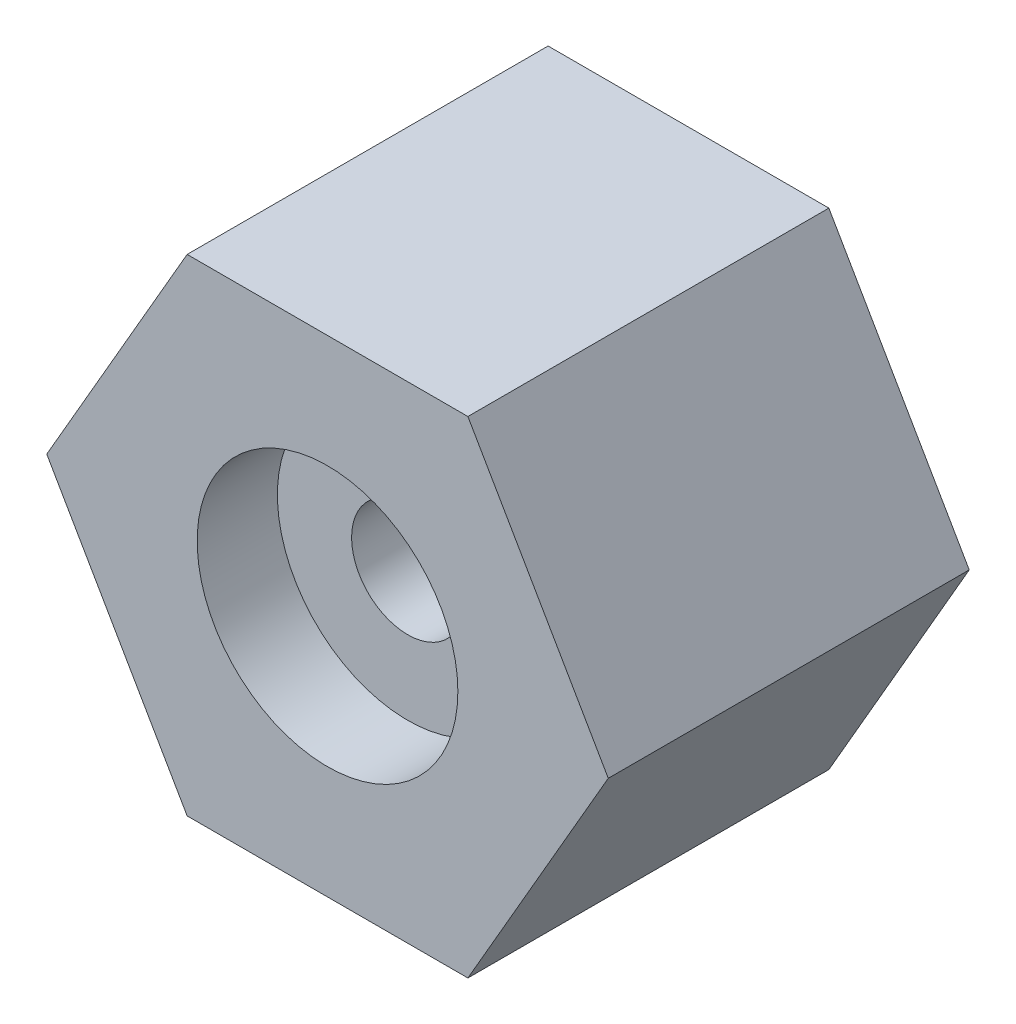
ISO-10303-21;
HEADER;
FILE_DESCRIPTION(('STEP AP214'),'2;1');
FILE_NAME('part.step','',(''),(''),'','','');
FILE_SCHEMA(('AUTOMOTIVE_DESIGN { 1 0 10303 214 1 1 1 1 }'));
ENDSEC;
DATA;
#1=APPLICATION_CONTEXT('core data for automotive mechanical design processes');
#2=APPLICATION_PROTOCOL_DEFINITION('international standard','automotive_design',2000,#1);
#3=PRODUCT_CONTEXT('',#1,'mechanical');
#4=PRODUCT('Part','Part','',(#3));
#5=PRODUCT_RELATED_PRODUCT_CATEGORY('part','',(#4));
#6=PRODUCT_DEFINITION_FORMATION('','',#4);
#7=PRODUCT_DEFINITION_CONTEXT('part definition',#1,'design');
#8=PRODUCT_DEFINITION('design','',#6,#7);
#9=PRODUCT_DEFINITION_SHAPE('','',#8);
#10=(LENGTH_UNIT() NAMED_UNIT(*) SI_UNIT(.MILLI.,.METRE.));
#11=(NAMED_UNIT(*) PLANE_ANGLE_UNIT() SI_UNIT($,.RADIAN.));
#12=(NAMED_UNIT(*) SI_UNIT($,.STERADIAN.) SOLID_ANGLE_UNIT());
#13=UNCERTAINTY_MEASURE_WITH_UNIT(LENGTH_MEASURE(1.E-05),#10,'distance_accuracy_value','');
#14=(GEOMETRIC_REPRESENTATION_CONTEXT(3) GLOBAL_UNCERTAINTY_ASSIGNED_CONTEXT((#13)) GLOBAL_UNIT_ASSIGNED_CONTEXT((#10,
#11,#12)) REPRESENTATION_CONTEXT('',''));
#15=CARTESIAN_POINT('',(0.,0.,0.));
#16=DIRECTION('',(0.,0.,1.));
#17=DIRECTION('',(1.,0.,0.));
#18=AXIS2_PLACEMENT_3D('',#15,#16,#17);
#19=CARTESIAN_POINT('',(-35.,0.,22.5));
#20=DIRECTION('',(0.866025403784439,-0.5,0.));
#21=DIRECTION('',(0.5,0.866025403784439,0.));
#22=AXIS2_PLACEMENT_3D('',#19,#20,#21);
#23=PLANE('',#22);
#24=DIRECTION('',(-0.5,-0.866025403784439,0.));
#25=VECTOR('',#24,1.);
#26=CARTESIAN_POINT('',(-35.,0.,-22.5));
#27=LINE('',#26,#25);
#28=CARTESIAN_POINT('',(-17.5,30.3108891324554,-22.5));
#29=VERTEX_POINT('',#28);
#30=CARTESIAN_POINT('',(-35.,0.,-22.5));
#31=VERTEX_POINT('',#30);
#32=EDGE_CURVE('E116',#29,#31,#27,.T.);
#33=ORIENTED_EDGE('',*,*,#32,.T.);
#34=DIRECTION('',(0.,0.,-1.));
#35=VECTOR('',#34,1.);
#36=CARTESIAN_POINT('',(-35.,0.,22.5));
#37=LINE('',#36,#35);
#38=CARTESIAN_POINT('',(-35.,0.,22.5));
#39=VERTEX_POINT('',#38);
#40=EDGE_CURVE('E11',#39,#31,#37,.T.);
#41=ORIENTED_EDGE('',*,*,#40,.F.);
#42=DIRECTION('',(-0.5,-0.866025403784439,0.));
#43=VECTOR('',#42,1.);
#44=CARTESIAN_POINT('',(-35.,0.,22.5));
#45=LINE('',#44,#43);
#46=CARTESIAN_POINT('',(-17.5,30.3108891324554,22.5));
#47=VERTEX_POINT('',#46);
#48=EDGE_CURVE('E127',#47,#39,#45,.T.);
#49=ORIENTED_EDGE('',*,*,#48,.F.);
#50=DIRECTION('',(0.,0.,-1.));
#51=VECTOR('',#50,1.);
#52=CARTESIAN_POINT('',(-17.5,30.3108891324554,22.5));
#53=LINE('',#52,#51);
#54=EDGE_CURVE('E112',#47,#29,#53,.T.);
#55=ORIENTED_EDGE('',*,*,#54,.T.);
#56=EDGE_LOOP('',(#33,#41,#49,#55));
#57=FACE_BOUND('',#56,.T.);
#58=ADVANCED_FACE('F32',(#57),#23,.F.);
#59=CARTESIAN_POINT('',(-17.5,-30.3108891324554,22.5));
#60=DIRECTION('',(0.866025403784439,0.5,0.));
#61=DIRECTION('',(-0.5,0.866025403784439,0.));
#62=AXIS2_PLACEMENT_3D('',#59,#60,#61);
#63=PLANE('',#62);
#64=DIRECTION('',(0.5,-0.866025403784439,0.));
#65=VECTOR('',#64,1.);
#66=CARTESIAN_POINT('',(-17.5,-30.3108891324554,-22.5));
#67=LINE('',#66,#65);
#68=CARTESIAN_POINT('',(-17.5,-30.3108891324554,-22.5));
#69=VERTEX_POINT('',#68);
#70=EDGE_CURVE('E119',#31,#69,#67,.T.);
#71=ORIENTED_EDGE('',*,*,#70,.T.);
#72=DIRECTION('',(0.,0.,-1.));
#73=VECTOR('',#72,1.);
#74=CARTESIAN_POINT('',(-17.5,-30.3108891324554,22.5));
#75=LINE('',#74,#73);
#76=CARTESIAN_POINT('',(-17.5,-30.3108891324554,22.5));
#77=VERTEX_POINT('',#76);
#78=EDGE_CURVE('E40',#77,#69,#75,.T.);
#79=ORIENTED_EDGE('',*,*,#78,.F.);
#80=DIRECTION('',(0.5,-0.866025403784439,0.));
#81=VECTOR('',#80,1.);
#82=CARTESIAN_POINT('',(-17.5,-30.3108891324554,22.5));
#83=LINE('',#82,#81);
#84=EDGE_CURVE('E85',#39,#77,#83,.T.);
#85=ORIENTED_EDGE('',*,*,#84,.F.);
#86=ORIENTED_EDGE('',*,*,#40,.T.);
#87=EDGE_LOOP('',(#71,#79,#85,#86));
#88=FACE_BOUND('',#87,.T.);
#89=ADVANCED_FACE('F152',(#88),#63,.F.);
#90=CARTESIAN_POINT('',(17.5,-30.3108891324554,22.5));
#91=DIRECTION('',(0.,1.,0.));
#92=DIRECTION('',(0.,0.,1.));
#93=AXIS2_PLACEMENT_3D('',#90,#91,#92);
#94=PLANE('',#93);
#95=DIRECTION('',(1.,0.,0.));
#96=VECTOR('',#95,1.);
#97=CARTESIAN_POINT('',(17.5,-30.3108891324554,-22.5));
#98=LINE('',#97,#96);
#99=CARTESIAN_POINT('',(17.5,-30.3108891324554,-22.5));
#100=VERTEX_POINT('',#99);
#101=EDGE_CURVE('E122',#69,#100,#98,.T.);
#102=ORIENTED_EDGE('',*,*,#101,.T.);
#103=DIRECTION('',(0.,0.,-1.));
#104=VECTOR('',#103,1.);
#105=CARTESIAN_POINT('',(17.5,-30.3108891324554,22.5));
#106=LINE('',#105,#104);
#107=CARTESIAN_POINT('',(17.5,-30.3108891324554,22.5));
#108=VERTEX_POINT('',#107);
#109=EDGE_CURVE('E107',#108,#100,#106,.T.);
#110=ORIENTED_EDGE('',*,*,#109,.F.);
#111=DIRECTION('',(1.,0.,0.));
#112=VECTOR('',#111,1.);
#113=CARTESIAN_POINT('',(17.5,-30.3108891324554,22.5));
#114=LINE('',#113,#112);
#115=EDGE_CURVE('E98',#77,#108,#114,.T.);
#116=ORIENTED_EDGE('',*,*,#115,.F.);
#117=ORIENTED_EDGE('',*,*,#78,.T.);
#118=EDGE_LOOP('',(#102,#110,#116,#117));
#119=FACE_BOUND('',#118,.T.);
#120=ADVANCED_FACE('F133',(#119),#94,.F.);
#121=CARTESIAN_POINT('',(35.,0.,22.5));
#122=DIRECTION('',(-0.866025403784439,0.5,0.));
#123=DIRECTION('',(-0.5,-0.866025403784439,0.));
#124=AXIS2_PLACEMENT_3D('',#121,#122,#123);
#125=PLANE('',#124);
#126=DIRECTION('',(0.5,0.866025403784439,0.));
#127=VECTOR('',#126,1.);
#128=CARTESIAN_POINT('',(35.,0.,-22.5));
#129=LINE('',#128,#127);
#130=CARTESIAN_POINT('',(35.,0.,-22.5));
#131=VERTEX_POINT('',#130);
#132=EDGE_CURVE('E106',#100,#131,#129,.T.);
#133=ORIENTED_EDGE('',*,*,#132,.T.);
#134=DIRECTION('',(0.,0.,-1.));
#135=VECTOR('',#134,1.);
#136=CARTESIAN_POINT('',(35.,0.,22.5));
#137=LINE('',#136,#135);
#138=CARTESIAN_POINT('',(35.,0.,22.5));
#139=VERTEX_POINT('',#138);
#140=EDGE_CURVE('E103',#139,#131,#137,.T.);
#141=ORIENTED_EDGE('',*,*,#140,.F.);
#142=DIRECTION('',(0.5,0.866025403784439,0.));
#143=VECTOR('',#142,1.);
#144=CARTESIAN_POINT('',(35.,0.,22.5));
#145=LINE('',#144,#143);
#146=EDGE_CURVE('E92',#108,#139,#145,.T.);
#147=ORIENTED_EDGE('',*,*,#146,.F.);
#148=ORIENTED_EDGE('',*,*,#109,.T.);
#149=EDGE_LOOP('',(#133,#141,#147,#148));
#150=FACE_BOUND('',#149,.T.);
#151=ADVANCED_FACE('F104',(#150),#125,.F.);
#152=CARTESIAN_POINT('',(17.5,30.3108891324554,22.5));
#153=DIRECTION('',(-0.866025403784439,-0.5,0.));
#154=DIRECTION('',(0.5,-0.866025403784439,0.));
#155=AXIS2_PLACEMENT_3D('',#152,#153,#154);
#156=PLANE('',#155);
#157=DIRECTION('',(-0.5,0.866025403784439,0.));
#158=VECTOR('',#157,1.);
#159=CARTESIAN_POINT('',(17.5,30.3108891324554,-22.5));
#160=LINE('',#159,#158);
#161=CARTESIAN_POINT('',(17.5,30.3108891324554,-22.5));
#162=VERTEX_POINT('',#161);
#163=EDGE_CURVE('E71',#131,#162,#160,.T.);
#164=ORIENTED_EDGE('',*,*,#163,.T.);
#165=DIRECTION('',(0.,0.,-1.));
#166=VECTOR('',#165,1.);
#167=CARTESIAN_POINT('',(17.5,30.3108891324554,22.5));
#168=LINE('',#167,#166);
#169=CARTESIAN_POINT('',(17.5,30.3108891324554,22.5));
#170=VERTEX_POINT('',#169);
#171=EDGE_CURVE('E108',#170,#162,#168,.T.);
#172=ORIENTED_EDGE('',*,*,#171,.F.);
#173=DIRECTION('',(-0.5,0.866025403784439,0.));
#174=VECTOR('',#173,1.);
#175=CARTESIAN_POINT('',(17.5,30.3108891324554,22.5));
#176=LINE('',#175,#174);
#177=EDGE_CURVE('E96',#139,#170,#176,.T.);
#178=ORIENTED_EDGE('',*,*,#177,.F.);
#179=ORIENTED_EDGE('',*,*,#140,.T.);
#180=EDGE_LOOP('',(#164,#172,#178,#179));
#181=FACE_BOUND('',#180,.T.);
#182=ADVANCED_FACE('F110',(#181),#156,.F.);
#183=CARTESIAN_POINT('',(-17.5,30.3108891324554,22.5));
#184=DIRECTION('',(0.,-1.,0.));
#185=DIRECTION('',(1.,0.,0.));
#186=AXIS2_PLACEMENT_3D('',#183,#184,#185);
#187=PLANE('',#186);
#188=DIRECTION('',(-1.,0.,0.));
#189=VECTOR('',#188,1.);
#190=CARTESIAN_POINT('',(-17.5,30.3108891324554,-22.5));
#191=LINE('',#190,#189);
#192=EDGE_CURVE('E77',#162,#29,#191,.T.);
#193=ORIENTED_EDGE('',*,*,#192,.T.);
#194=ORIENTED_EDGE('',*,*,#54,.F.);
#195=DIRECTION('',(-1.,0.,0.));
#196=VECTOR('',#195,1.);
#197=CARTESIAN_POINT('',(-17.5,30.3108891324554,22.5));
#198=LINE('',#197,#196);
#199=EDGE_CURVE('E48',#170,#47,#198,.T.);
#200=ORIENTED_EDGE('',*,*,#199,.F.);
#201=ORIENTED_EDGE('',*,*,#171,.T.);
#202=EDGE_LOOP('',(#193,#194,#200,#201));
#203=FACE_BOUND('',#202,.T.);
#204=ADVANCED_FACE('F140',(#203),#187,.F.);
#205=CARTESIAN_POINT('',(0.,0.,22.5));
#206=DIRECTION('',(0.,0.,-1.));
#207=DIRECTION('',(-1.,0.,0.));
#208=AXIS2_PLACEMENT_3D('',#205,#206,#207);
#209=PLANE('',#208);
#210=CARTESIAN_POINT('',(0.,0.,22.5));
#211=DIRECTION('',(0.,0.,1.));
#212=DIRECTION('',(1.,0.,0.));
#213=AXIS2_PLACEMENT_3D('',#210,#211,#212);
#214=CIRCLE('',#213,16.25);
#215=CARTESIAN_POINT('',(16.25,0.,22.5));
#216=VERTEX_POINT('',#215);
#217=EDGE_CURVE('E257',#216,#216,#214,.T.);
#218=ORIENTED_EDGE('',*,*,#217,.F.);
#219=EDGE_LOOP('',(#218));
#220=FACE_BOUND('',#219,.T.);
#221=ORIENTED_EDGE('',*,*,#48,.T.);
#222=ORIENTED_EDGE('',*,*,#84,.T.);
#223=ORIENTED_EDGE('',*,*,#115,.T.);
#224=ORIENTED_EDGE('',*,*,#146,.T.);
#225=ORIENTED_EDGE('',*,*,#177,.T.);
#226=ORIENTED_EDGE('',*,*,#199,.T.);
#227=EDGE_LOOP('',(#221,#222,#223,#224,#225,#226));
#228=FACE_BOUND('',#227,.T.);
#229=ADVANCED_FACE('F94',(#220,#228),#209,.F.);
#230=CARTESIAN_POINT('',(0.,0.,-22.5));
#231=DIRECTION('',(0.,0.,-1.));
#232=DIRECTION('',(-1.,0.,0.));
#233=AXIS2_PLACEMENT_3D('',#230,#231,#232);
#234=PLANE('',#233);
#235=CARTESIAN_POINT('',(0.,0.,-22.5));
#236=DIRECTION('',(0.,0.,1.));
#237=DIRECTION('',(1.,0.,0.));
#238=AXIS2_PLACEMENT_3D('',#235,#236,#237);
#239=CIRCLE('',#238,16.25);
#240=CARTESIAN_POINT('',(16.25,0.,-22.5));
#241=VERTEX_POINT('',#240);
#242=EDGE_CURVE('E249',#241,#241,#239,.T.);
#243=ORIENTED_EDGE('',*,*,#242,.T.);
#244=EDGE_LOOP('',(#243));
#245=FACE_BOUND('',#244,.T.);
#246=ORIENTED_EDGE('',*,*,#32,.F.);
#247=ORIENTED_EDGE('',*,*,#192,.F.);
#248=ORIENTED_EDGE('',*,*,#163,.F.);
#249=ORIENTED_EDGE('',*,*,#132,.F.);
#250=ORIENTED_EDGE('',*,*,#101,.F.);
#251=ORIENTED_EDGE('',*,*,#70,.F.);
#252=EDGE_LOOP('',(#246,#247,#248,#249,#250,#251));
#253=FACE_BOUND('',#252,.T.);
#254=ADVANCED_FACE('F136',(#245,#253),#234,.T.);
#255=CARTESIAN_POINT('',(0.,0.,12.5));
#256=DIRECTION('',(0.,0.,1.));
#257=DIRECTION('',(1.,0.,0.));
#258=AXIS2_PLACEMENT_3D('',#255,#256,#257);
#259=CYLINDRICAL_SURFACE('',#258,16.25);
#260=CARTESIAN_POINT('',(0.,0.,12.5));
#261=DIRECTION('',(0.,0.,1.));
#262=DIRECTION('',(1.,0.,0.));
#263=AXIS2_PLACEMENT_3D('',#260,#261,#262);
#264=CIRCLE('',#263,16.25);
#265=CARTESIAN_POINT('',(16.25,0.,12.5));
#266=VERTEX_POINT('',#265);
#267=EDGE_CURVE('E120',#266,#266,#264,.T.);
#268=ORIENTED_EDGE('',*,*,#267,.F.);
#269=EDGE_LOOP('',(#268));
#270=FACE_BOUND('',#269,.T.);
#271=ORIENTED_EDGE('',*,*,#217,.T.);
#272=EDGE_LOOP('',(#271));
#273=FACE_BOUND('',#272,.T.);
#274=ADVANCED_FACE('F187',(#270,#273),#259,.F.);
#275=CARTESIAN_POINT('',(0.,0.,12.5));
#276=DIRECTION('',(0.,0.,1.));
#277=DIRECTION('',(1.,0.,0.));
#278=AXIS2_PLACEMENT_3D('',#275,#276,#277);
#279=PLANE('',#278);
#280=CARTESIAN_POINT('',(0.,0.,12.5));
#281=DIRECTION('',(0.,0.,1.));
#282=DIRECTION('',(1.,0.,0.));
#283=AXIS2_PLACEMENT_3D('',#280,#281,#282);
#284=CIRCLE('',#283,7.);
#285=CARTESIAN_POINT('',(7.,0.,12.5));
#286=VERTEX_POINT('',#285);
#287=EDGE_CURVE('E248',#286,#286,#284,.F.);
#288=ORIENTED_EDGE('',*,*,#287,.T.);
#289=EDGE_LOOP('',(#288));
#290=FACE_BOUND('',#289,.T.);
#291=ORIENTED_EDGE('',*,*,#267,.T.);
#292=EDGE_LOOP('',(#291));
#293=FACE_BOUND('',#292,.T.);
#294=ADVANCED_FACE('F192',(#290,#293),#279,.T.);
#295=CARTESIAN_POINT('',(0.,0.,-12.5));
#296=DIRECTION('',(0.,0.,-1.));
#297=DIRECTION('',(-1.,0.,0.));
#298=AXIS2_PLACEMENT_3D('',#295,#296,#297);
#299=CYLINDRICAL_SURFACE('',#298,16.25);
#300=CARTESIAN_POINT('',(0.,0.,-12.5));
#301=DIRECTION('',(0.,0.,1.));
#302=DIRECTION('',(1.,0.,0.));
#303=AXIS2_PLACEMENT_3D('',#300,#301,#302);
#304=CIRCLE('',#303,16.25);
#305=CARTESIAN_POINT('',(16.25,0.,-12.5));
#306=VERTEX_POINT('',#305);
#307=EDGE_CURVE('E252',#306,#306,#304,.T.);
#308=ORIENTED_EDGE('',*,*,#307,.T.);
#309=EDGE_LOOP('',(#308));
#310=FACE_BOUND('',#309,.T.);
#311=ORIENTED_EDGE('',*,*,#242,.F.);
#312=EDGE_LOOP('',(#311));
#313=FACE_BOUND('',#312,.T.);
#314=ADVANCED_FACE('F206',(#310,#313),#299,.F.);
#315=CARTESIAN_POINT('',(0.,0.,-12.5));
#316=DIRECTION('',(0.,0.,-1.));
#317=DIRECTION('',(1.,0.,0.));
#318=AXIS2_PLACEMENT_3D('',#315,#316,#317);
#319=PLANE('',#318);
#320=CARTESIAN_POINT('',(0.,0.,-12.5));
#321=DIRECTION('',(0.,0.,-1.));
#322=DIRECTION('',(-1.,0.,0.));
#323=AXIS2_PLACEMENT_3D('',#320,#321,#322);
#324=CIRCLE('',#323,7.);
#325=CARTESIAN_POINT('',(-7.,0.,-12.5));
#326=VERTEX_POINT('',#325);
#327=EDGE_CURVE('E245',#326,#326,#324,.T.);
#328=ORIENTED_EDGE('',*,*,#327,.F.);
#329=EDGE_LOOP('',(#328));
#330=FACE_BOUND('',#329,.T.);
#331=ORIENTED_EDGE('',*,*,#307,.F.);
#332=EDGE_LOOP('',(#331));
#333=FACE_BOUND('',#332,.T.);
#334=ADVANCED_FACE('F211',(#330,#333),#319,.T.);
#335=CARTESIAN_POINT('',(0.,0.,32.2989898732233));
#336=DIRECTION('',(0.,0.,-1.));
#337=DIRECTION('',(-1.,0.,0.));
#338=AXIS2_PLACEMENT_3D('',#335,#336,#337);
#339=CYLINDRICAL_SURFACE('',#338,7.);
#340=ORIENTED_EDGE('',*,*,#327,.T.);
#341=EDGE_LOOP('',(#340));
#342=FACE_BOUND('',#341,.T.);
#343=ORIENTED_EDGE('',*,*,#287,.F.);
#344=EDGE_LOOP('',(#343));
#345=FACE_BOUND('',#344,.T.);
#346=ADVANCED_FACE('F228',(#342,#345),#339,.F.);
#347=CLOSED_SHELL('',(#58,#89,#120,#151,#182,#204,#229,#254,#274,#294,#314,#334,#346));
#348=MANIFOLD_SOLID_BREP('B2',#347);
#349=ADVANCED_BREP_SHAPE_REPRESENTATION('',(#18,#348),#14);
#350=SHAPE_DEFINITION_REPRESENTATION(#9,#349);
ENDSEC;
END-ISO-10303-21;
